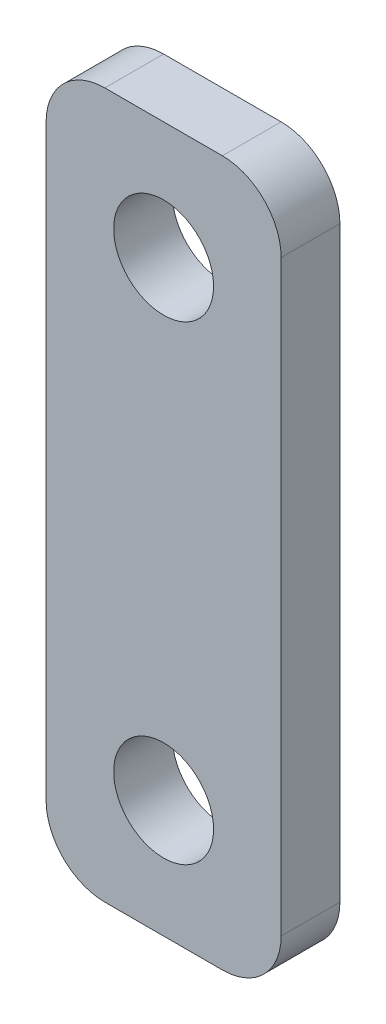
ISO-10303-21;
HEADER;
FILE_DESCRIPTION(('STEP AP214'),'2;1');
FILE_NAME('part.step','',(''),(''),'','','');
FILE_SCHEMA(('AUTOMOTIVE_DESIGN { 1 0 10303 214 1 1 1 1 }'));
ENDSEC;
DATA;
#1=APPLICATION_CONTEXT('core data for automotive mechanical design processes');
#2=APPLICATION_PROTOCOL_DEFINITION('international standard','automotive_design',2000,#1);
#3=PRODUCT_CONTEXT('',#1,'mechanical');
#4=PRODUCT('Part','Part','',(#3));
#5=PRODUCT_RELATED_PRODUCT_CATEGORY('part','',(#4));
#6=PRODUCT_DEFINITION_FORMATION('','',#4);
#7=PRODUCT_DEFINITION_CONTEXT('part definition',#1,'design');
#8=PRODUCT_DEFINITION('design','',#6,#7);
#9=PRODUCT_DEFINITION_SHAPE('','',#8);
#10=(LENGTH_UNIT() NAMED_UNIT(*) SI_UNIT(.MILLI.,.METRE.));
#11=(NAMED_UNIT(*) PLANE_ANGLE_UNIT() SI_UNIT($,.RADIAN.));
#12=(NAMED_UNIT(*) SI_UNIT($,.STERADIAN.) SOLID_ANGLE_UNIT());
#13=UNCERTAINTY_MEASURE_WITH_UNIT(LENGTH_MEASURE(1.E-05),#10,'distance_accuracy_value','');
#14=(GEOMETRIC_REPRESENTATION_CONTEXT(3) GLOBAL_UNCERTAINTY_ASSIGNED_CONTEXT((#13)) GLOBAL_UNIT_ASSIGNED_CONTEXT((#10,
#11,#12)) REPRESENTATION_CONTEXT('',''));
#15=CARTESIAN_POINT('',(0.,0.,0.));
#16=DIRECTION('',(0.,0.,1.));
#17=DIRECTION('',(1.,0.,0.));
#18=AXIS2_PLACEMENT_3D('',#15,#16,#17);
#19=CARTESIAN_POINT('',(49.9999999999998,60.0000000000002,5.00000000000014));
#20=DIRECTION('',(0.999999999999995,0.,0.));
#21=DIRECTION('',(0.,1.,0.));
#22=AXIS2_PLACEMENT_3D('',#19,#20,#21);
#23=PLANE('',#22);
#24=DIRECTION('',(0.,-1.,0.));
#25=VECTOR('',#24,1.);
#26=CARTESIAN_POINT('',(49.9999999999993,60.0000000000006,-5.00000000000003));
#27=LINE('',#26,#25);
#28=CARTESIAN_POINT('',(49.9999999999995,49.9999999999999,-4.99999999999978));
#29=VERTEX_POINT('',#28);
#30=CARTESIAN_POINT('',(49.9999999999996,-50.,-4.99999999999978));
#31=VERTEX_POINT('',#30);
#32=EDGE_CURVE('E142',#29,#31,#27,.T.);
#33=ORIENTED_EDGE('',*,*,#32,.T.);
#34=DIRECTION('',(0.,0.,-1.));
#35=VECTOR('',#34,1.);
#36=CARTESIAN_POINT('',(49.9999999999997,-50.,5.0000000000005));
#37=LINE('',#36,#35);
#38=CARTESIAN_POINT('',(49.9999999999997,-50.,5.0000000000005));
#39=VERTEX_POINT('',#38);
#40=EDGE_CURVE('E117',#31,#39,#37,.F.);
#41=ORIENTED_EDGE('',*,*,#40,.T.);
#42=DIRECTION('',(0.,-1.,0.));
#43=VECTOR('',#42,1.);
#44=CARTESIAN_POINT('',(49.9999999999998,60.0000000000002,5.00000000000014));
#45=LINE('',#44,#43);
#46=CARTESIAN_POINT('',(49.9999999999996,50.0000000000002,5.00000000000014));
#47=VERTEX_POINT('',#46);
#48=EDGE_CURVE('E156',#47,#39,#45,.T.);
#49=ORIENTED_EDGE('',*,*,#48,.F.);
#50=DIRECTION('',(0.,0.,-1.));
#51=VECTOR('',#50,1.);
#52=CARTESIAN_POINT('',(49.9999999999996,50.0000000000002,5.00000000000014));
#53=LINE('',#52,#51);
#54=EDGE_CURVE('E123',#47,#29,#53,.T.);
#55=ORIENTED_EDGE('',*,*,#54,.T.);
#56=EDGE_LOOP('',(#33,#41,#49,#55));
#57=FACE_BOUND('',#56,.T.);
#58=ADVANCED_FACE('F45',(#57),#23,.F.);
#59=CARTESIAN_POINT('',(49.9999999999996,-60.,5.00000000000037));
#60=DIRECTION('',(0.,1.,0.));
#61=DIRECTION('',(0.,0.,1.));
#62=AXIS2_PLACEMENT_3D('',#59,#60,#61);
#63=PLANE('',#62);
#64=DIRECTION('',(0.999999999999995,0.,0.));
#65=VECTOR('',#64,1.);
#66=CARTESIAN_POINT('',(49.9999999999996,-60.,5.00000000000037));
#67=LINE('',#66,#65);
#68=CARTESIAN_POINT('',(59.9999999999995,-60.,4.99999999999992));
#69=VERTEX_POINT('',#68);
#70=CARTESIAN_POINT('',(79.9999999999994,-60.,5.00000000000006));
#71=VERTEX_POINT('',#70);
#72=EDGE_CURVE('E133',#69,#71,#67,.T.);
#73=ORIENTED_EDGE('',*,*,#72,.F.);
#74=DIRECTION('',(0.,0.,-1.));
#75=VECTOR('',#74,1.);
#76=CARTESIAN_POINT('',(59.9999999999995,-60.,4.99999999999992));
#77=LINE('',#76,#75);
#78=CARTESIAN_POINT('',(59.9999999999997,-60.,-4.99999999999995));
#79=VERTEX_POINT('',#78);
#80=EDGE_CURVE('E116',#69,#79,#77,.T.);
#81=ORIENTED_EDGE('',*,*,#80,.T.);
#82=DIRECTION('',(0.999999999999995,0.,0.));
#83=VECTOR('',#82,1.);
#84=CARTESIAN_POINT('',(49.9999999999996,-60.,-4.99999999999937));
#85=LINE('',#84,#83);
#86=CARTESIAN_POINT('',(79.9999999999995,-60.,-4.99999999999967));
#87=VERTEX_POINT('',#86);
#88=EDGE_CURVE('E130',#79,#87,#85,.T.);
#89=ORIENTED_EDGE('',*,*,#88,.T.);
#90=DIRECTION('',(0.,0.,-1.));
#91=VECTOR('',#90,1.);
#92=CARTESIAN_POINT('',(79.9999999999994,-60.,5.00000000000006));
#93=LINE('',#92,#91);
#94=EDGE_CURVE('E136',#87,#71,#93,.F.);
#95=ORIENTED_EDGE('',*,*,#94,.T.);
#96=EDGE_LOOP('',(#73,#81,#89,#95));
#97=FACE_BOUND('',#96,.T.);
#98=ADVANCED_FACE('F129',(#97),#63,.F.);
#99=CARTESIAN_POINT('',(89.9999999999992,60.0000000000002,4.99999999999989));
#100=DIRECTION('',(-0.999999999999995,0.,0.));
#101=DIRECTION('',(0.,-1.,0.));
#102=AXIS2_PLACEMENT_3D('',#99,#100,#101);
#103=PLANE('',#102);
#104=DIRECTION('',(0.,1.,0.));
#105=VECTOR('',#104,1.);
#106=CARTESIAN_POINT('',(89.9999999999992,60.0000000000002,4.99999999999989));
#107=LINE('',#106,#105);
#108=CARTESIAN_POINT('',(89.999999999999,-49.9999999999998,5.00000000000039));
#109=VERTEX_POINT('',#108);
#110=CARTESIAN_POINT('',(89.9999999999991,50.0000000000001,5.00000000000009));
#111=VERTEX_POINT('',#110);
#112=EDGE_CURVE('E209',#109,#111,#107,.T.);
#113=ORIENTED_EDGE('',*,*,#112,.F.);
#114=DIRECTION('',(0.,0.,-1.));
#115=VECTOR('',#114,1.);
#116=CARTESIAN_POINT('',(89.999999999999,-49.9999999999998,5.00000000000039));
#117=LINE('',#116,#115);
#118=CARTESIAN_POINT('',(89.9999999999994,-49.9999999999999,-4.99999999999967));
#119=VERTEX_POINT('',#118);
#120=EDGE_CURVE('E186',#109,#119,#117,.T.);
#121=ORIENTED_EDGE('',*,*,#120,.T.);
#122=DIRECTION('',(0.,1.,0.));
#123=VECTOR('',#122,1.);
#124=CARTESIAN_POINT('',(89.9999999999985,60.0000000000001,-4.99999999999953));
#125=LINE('',#124,#123);
#126=CARTESIAN_POINT('',(89.9999999999996,50.0000000000002,-4.99999999999995));
#127=VERTEX_POINT('',#126);
#128=EDGE_CURVE('E141',#119,#127,#125,.T.);
#129=ORIENTED_EDGE('',*,*,#128,.T.);
#130=DIRECTION('',(0.,0.,-1.));
#131=VECTOR('',#130,1.);
#132=CARTESIAN_POINT('',(89.9999999999991,50.0000000000001,5.00000000000009));
#133=LINE('',#132,#131);
#134=EDGE_CURVE('E183',#127,#111,#133,.F.);
#135=ORIENTED_EDGE('',*,*,#134,.T.);
#136=EDGE_LOOP('',(#113,#121,#129,#135));
#137=FACE_BOUND('',#136,.T.);
#138=ADVANCED_FACE('F270',(#137),#103,.F.);
#139=CARTESIAN_POINT('',(49.9999999999998,60.0000000000002,5.00000000000014));
#140=DIRECTION('',(0.,-1.,0.));
#141=DIRECTION('',(0.999999999999995,0.,0.));
#142=AXIS2_PLACEMENT_3D('',#139,#140,#141);
#143=PLANE('',#142);
#144=DIRECTION('',(-0.999999999999995,0.,0.));
#145=VECTOR('',#144,1.);
#146=CARTESIAN_POINT('',(49.9999999999998,60.0000000000002,5.00000000000014));
#147=LINE('',#146,#145);
#148=CARTESIAN_POINT('',(79.9999999999994,60.0000000000001,5.00000000000006));
#149=VERTEX_POINT('',#148);
#150=CARTESIAN_POINT('',(59.9999999999993,60.0000000000001,5.00000000000006));
#151=VERTEX_POINT('',#150);
#152=EDGE_CURVE('E158',#149,#151,#147,.T.);
#153=ORIENTED_EDGE('',*,*,#152,.F.);
#154=DIRECTION('',(0.,0.,-1.));
#155=VECTOR('',#154,1.);
#156=CARTESIAN_POINT('',(79.9999999999994,60.0000000000001,5.00000000000006));
#157=LINE('',#156,#155);
#158=CARTESIAN_POINT('',(79.9999999999988,60.0000000000001,-4.99999999999962));
#159=VERTEX_POINT('',#158);
#160=EDGE_CURVE('E11',#149,#159,#157,.T.);
#161=ORIENTED_EDGE('',*,*,#160,.T.);
#162=DIRECTION('',(-0.999999999999995,0.,0.));
#163=VECTOR('',#162,1.);
#164=CARTESIAN_POINT('',(49.9999999999993,60.0000000000006,-5.00000000000003));
#165=LINE('',#164,#163);
#166=CARTESIAN_POINT('',(59.9999999999996,60.0000000000001,-4.99999999999981));
#167=VERTEX_POINT('',#166);
#168=EDGE_CURVE('E148',#159,#167,#165,.T.);
#169=ORIENTED_EDGE('',*,*,#168,.T.);
#170=DIRECTION('',(0.,0.,-1.));
#171=VECTOR('',#170,1.);
#172=CARTESIAN_POINT('',(59.9999999999993,60.0000000000001,5.00000000000006));
#173=LINE('',#172,#171);
#174=EDGE_CURVE('E54',#167,#151,#173,.F.);
#175=ORIENTED_EDGE('',*,*,#174,.T.);
#176=EDGE_LOOP('',(#153,#161,#169,#175));
#177=FACE_BOUND('',#176,.T.);
#178=ADVANCED_FACE('F252',(#177),#143,.F.);
#179=CARTESIAN_POINT('',(-6.66133814775094E-13,0.,5.00000000000031));
#180=DIRECTION('',(0.,0.,1.));
#181=DIRECTION('',(0.999999999999995,0.,0.));
#182=AXIS2_PLACEMENT_3D('',#179,#180,#181);
#183=PLANE('',#182);
#184=CARTESIAN_POINT('',(70.0000000000001,-40.,5.00000000000014));
#185=DIRECTION('',(0.,0.,1.));
#186=DIRECTION('',(0.999999999999995,0.,0.));
#187=AXIS2_PLACEMENT_3D('',#184,#185,#186);
#188=CIRCLE('',#187,8.5);
#189=CARTESIAN_POINT('',(78.5,-40.,5.00000000000014));
#190=VERTEX_POINT('',#189);
#191=EDGE_CURVE('E231',#190,#190,#188,.T.);
#192=ORIENTED_EDGE('',*,*,#191,.F.);
#193=EDGE_LOOP('',(#192));
#194=FACE_BOUND('',#193,.T.);
#195=CARTESIAN_POINT('',(69.9999999999993,40.,5.00000000000014));
#196=DIRECTION('',(0.,0.,1.));
#197=DIRECTION('',(0.999999999999995,0.,0.));
#198=AXIS2_PLACEMENT_3D('',#195,#196,#197);
#199=CIRCLE('',#198,8.5);
#200=CARTESIAN_POINT('',(78.4999999999992,40.,5.00000000000014));
#201=VERTEX_POINT('',#200);
#202=EDGE_CURVE('E223',#201,#201,#199,.T.);
#203=ORIENTED_EDGE('',*,*,#202,.F.);
#204=EDGE_LOOP('',(#203));
#205=FACE_BOUND('',#204,.T.);
#206=ORIENTED_EDGE('',*,*,#48,.T.);
#207=CARTESIAN_POINT('',(60.0000000000001,-50.,4.99999999999987));
#208=DIRECTION('',(0.,0.,1.));
#209=DIRECTION('',(0.999999999999995,0.,0.));
#210=AXIS2_PLACEMENT_3D('',#207,#208,#209);
#211=CIRCLE('',#210,10.);
#212=EDGE_CURVE('E180',#39,#69,#211,.T.);
#213=ORIENTED_EDGE('',*,*,#212,.T.);
#214=ORIENTED_EDGE('',*,*,#72,.T.);
#215=CARTESIAN_POINT('',(79.9999999999992,-49.9999999999996,5.00000000000025));
#216=DIRECTION('',(0.,0.,1.));
#217=DIRECTION('',(0.999999999999995,0.,0.));
#218=AXIS2_PLACEMENT_3D('',#215,#216,#217);
#219=CIRCLE('',#218,10.);
#220=EDGE_CURVE('E177',#71,#109,#219,.T.);
#221=ORIENTED_EDGE('',*,*,#220,.T.);
#222=ORIENTED_EDGE('',*,*,#112,.T.);
#223=CARTESIAN_POINT('',(79.9999999999987,50.,5.00000000000023));
#224=DIRECTION('',(0.,0.,1.));
#225=DIRECTION('',(0.999999999999995,0.,0.));
#226=AXIS2_PLACEMENT_3D('',#223,#224,#225);
#227=CIRCLE('',#226,10.);
#228=EDGE_CURVE('E67',#111,#149,#227,.T.);
#229=ORIENTED_EDGE('',*,*,#228,.T.);
#230=ORIENTED_EDGE('',*,*,#152,.T.);
#231=CARTESIAN_POINT('',(59.9999999999992,50.,5.00000000000034));
#232=DIRECTION('',(0.,0.,1.));
#233=DIRECTION('',(0.999999999999995,0.,0.));
#234=AXIS2_PLACEMENT_3D('',#231,#232,#233);
#235=CIRCLE('',#234,10.);
#236=EDGE_CURVE('E172',#151,#47,#235,.T.);
#237=ORIENTED_EDGE('',*,*,#236,.T.);
#238=EDGE_LOOP('',(#206,#213,#214,#221,#222,#229,#230,#237));
#239=FACE_BOUND('',#238,.T.);
#240=ADVANCED_FACE('F249',(#194,#205,#239),#183,.T.);
#241=CARTESIAN_POINT('',(-5.55111512312578E-13,2.77555756156289E-13,-4.99999999999967));
#242=DIRECTION('',(0.,0.,1.));
#243=DIRECTION('',(0.999999999999995,0.,0.));
#244=AXIS2_PLACEMENT_3D('',#241,#242,#243);
#245=PLANE('',#244);
#246=CARTESIAN_POINT('',(69.9999999999994,-40.,-4.99999999999987));
#247=DIRECTION('',(0.,0.,1.));
#248=DIRECTION('',(0.999999999999995,0.,0.));
#249=AXIS2_PLACEMENT_3D('',#246,#247,#248);
#250=CIRCLE('',#249,8.5);
#251=CARTESIAN_POINT('',(78.4999999999993,-40.,-4.99999999999987));
#252=VERTEX_POINT('',#251);
#253=EDGE_CURVE('E227',#252,#252,#250,.T.);
#254=ORIENTED_EDGE('',*,*,#253,.T.);
#255=EDGE_LOOP('',(#254));
#256=FACE_BOUND('',#255,.T.);
#257=CARTESIAN_POINT('',(69.9999999999994,40.0000000000001,-4.99999999999992));
#258=DIRECTION('',(0.,0.,1.));
#259=DIRECTION('',(0.999999999999995,0.,0.));
#260=AXIS2_PLACEMENT_3D('',#257,#258,#259);
#261=CIRCLE('',#260,8.5);
#262=CARTESIAN_POINT('',(78.4999999999993,40.0000000000001,-4.99999999999993));
#263=VERTEX_POINT('',#262);
#264=EDGE_CURVE('E150',#263,#263,#261,.T.);
#265=ORIENTED_EDGE('',*,*,#264,.T.);
#266=EDGE_LOOP('',(#265));
#267=FACE_BOUND('',#266,.T.);
#268=ORIENTED_EDGE('',*,*,#88,.F.);
#269=CARTESIAN_POINT('',(59.9999999999989,-50.,-4.99999999999975));
#270=DIRECTION('',(0.,0.,1.));
#271=DIRECTION('',(0.999999999999995,0.,0.));
#272=AXIS2_PLACEMENT_3D('',#269,#270,#271);
#273=CIRCLE('',#272,10.);
#274=EDGE_CURVE('E112',#79,#31,#273,.F.);
#275=ORIENTED_EDGE('',*,*,#274,.T.);
#276=ORIENTED_EDGE('',*,*,#32,.F.);
#277=CARTESIAN_POINT('',(59.9999999999995,50.0000000000001,-4.99999999999973));
#278=DIRECTION('',(0.,0.,1.));
#279=DIRECTION('',(0.999999999999995,0.,0.));
#280=AXIS2_PLACEMENT_3D('',#277,#278,#279);
#281=CIRCLE('',#280,10.);
#282=EDGE_CURVE('E135',#29,#167,#281,.F.);
#283=ORIENTED_EDGE('',*,*,#282,.T.);
#284=ORIENTED_EDGE('',*,*,#168,.F.);
#285=CARTESIAN_POINT('',(79.9999999999991,50.0000000000002,-4.99999999999987));
#286=DIRECTION('',(0.,0.,1.));
#287=DIRECTION('',(0.999999999999995,0.,0.));
#288=AXIS2_PLACEMENT_3D('',#285,#286,#287);
#289=CIRCLE('',#288,10.);
#290=EDGE_CURVE('E162',#159,#127,#289,.F.);
#291=ORIENTED_EDGE('',*,*,#290,.T.);
#292=ORIENTED_EDGE('',*,*,#128,.F.);
#293=CARTESIAN_POINT('',(79.999999999999,-49.9999999999999,-4.99999999999967));
#294=DIRECTION('',(0.,0.,1.));
#295=DIRECTION('',(0.999999999999995,0.,0.));
#296=AXIS2_PLACEMENT_3D('',#293,#294,#295);
#297=CIRCLE('',#296,10.);
#298=EDGE_CURVE('E124',#119,#87,#297,.F.);
#299=ORIENTED_EDGE('',*,*,#298,.T.);
#300=EDGE_LOOP('',(#268,#275,#276,#283,#284,#291,#292,#299));
#301=FACE_BOUND('',#300,.T.);
#302=ADVANCED_FACE('F138',(#256,#267,#301),#245,.F.);
#303=CARTESIAN_POINT('',(69.9999999999994,40.0000000000001,-4.99999999999992));
#304=DIRECTION('',(0.,0.,1.));
#305=DIRECTION('',(0.999999999999995,0.,0.));
#306=AXIS2_PLACEMENT_3D('',#303,#304,#305);
#307=CYLINDRICAL_SURFACE('',#306,8.5);
#308=ORIENTED_EDGE('',*,*,#264,.F.);
#309=EDGE_LOOP('',(#308));
#310=FACE_BOUND('',#309,.T.);
#311=ORIENTED_EDGE('',*,*,#202,.T.);
#312=EDGE_LOOP('',(#311));
#313=FACE_BOUND('',#312,.T.);
#314=ADVANCED_FACE('F245',(#310,#313),#307,.F.);
#315=CARTESIAN_POINT('',(69.9999999999994,-40.,-4.99999999999987));
#316=DIRECTION('',(0.,0.,1.));
#317=DIRECTION('',(0.999999999999995,0.,0.));
#318=AXIS2_PLACEMENT_3D('',#315,#316,#317);
#319=CYLINDRICAL_SURFACE('',#318,8.5);
#320=ORIENTED_EDGE('',*,*,#253,.F.);
#321=EDGE_LOOP('',(#320));
#322=FACE_BOUND('',#321,.T.);
#323=ORIENTED_EDGE('',*,*,#191,.T.);
#324=EDGE_LOOP('',(#323));
#325=FACE_BOUND('',#324,.T.);
#326=ADVANCED_FACE('F242',(#322,#325),#319,.F.);
#327=CARTESIAN_POINT('',(60.0000000000001,-50.,4.99999999999987));
#328=DIRECTION('',(0.,0.,-1.));
#329=DIRECTION('',(-0.999999999999995,0.,0.));
#330=AXIS2_PLACEMENT_3D('',#327,#328,#329);
#331=CYLINDRICAL_SURFACE('',#330,10.);
#332=ORIENTED_EDGE('',*,*,#212,.F.);
#333=ORIENTED_EDGE('',*,*,#40,.F.);
#334=ORIENTED_EDGE('',*,*,#274,.F.);
#335=ORIENTED_EDGE('',*,*,#80,.F.);
#336=EDGE_LOOP('',(#332,#333,#334,#335));
#337=FACE_BOUND('',#336,.T.);
#338=ADVANCED_FACE('F115',(#337),#331,.T.);
#339=CARTESIAN_POINT('',(79.9999999999992,-49.9999999999996,5.00000000000025));
#340=DIRECTION('',(0.,0.,-1.));
#341=DIRECTION('',(-0.999999999999995,0.,0.));
#342=AXIS2_PLACEMENT_3D('',#339,#340,#341);
#343=CYLINDRICAL_SURFACE('',#342,10.);
#344=ORIENTED_EDGE('',*,*,#220,.F.);
#345=ORIENTED_EDGE('',*,*,#94,.F.);
#346=ORIENTED_EDGE('',*,*,#298,.F.);
#347=ORIENTED_EDGE('',*,*,#120,.F.);
#348=EDGE_LOOP('',(#344,#345,#346,#347));
#349=FACE_BOUND('',#348,.T.);
#350=ADVANCED_FACE('F276',(#349),#343,.T.);
#351=CARTESIAN_POINT('',(79.9999999999987,50.,5.00000000000023));
#352=DIRECTION('',(0.,0.,-1.));
#353=DIRECTION('',(-0.999999999999995,0.,0.));
#354=AXIS2_PLACEMENT_3D('',#351,#352,#353);
#355=CYLINDRICAL_SURFACE('',#354,10.);
#356=ORIENTED_EDGE('',*,*,#228,.F.);
#357=ORIENTED_EDGE('',*,*,#134,.F.);
#358=ORIENTED_EDGE('',*,*,#290,.F.);
#359=ORIENTED_EDGE('',*,*,#160,.F.);
#360=EDGE_LOOP('',(#356,#357,#358,#359));
#361=FACE_BOUND('',#360,.T.);
#362=ADVANCED_FACE('F278',(#361),#355,.T.);
#363=CARTESIAN_POINT('',(59.9999999999992,50.,5.00000000000034));
#364=DIRECTION('',(0.,0.,-1.));
#365=DIRECTION('',(-0.999999999999995,0.,0.));
#366=AXIS2_PLACEMENT_3D('',#363,#364,#365);
#367=CYLINDRICAL_SURFACE('',#366,10.);
#368=ORIENTED_EDGE('',*,*,#236,.F.);
#369=ORIENTED_EDGE('',*,*,#174,.F.);
#370=ORIENTED_EDGE('',*,*,#282,.F.);
#371=ORIENTED_EDGE('',*,*,#54,.F.);
#372=EDGE_LOOP('',(#368,#369,#370,#371));
#373=FACE_BOUND('',#372,.T.);
#374=ADVANCED_FACE('F47',(#373),#367,.T.);
#375=CLOSED_SHELL('',(#58,#98,#138,#178,#240,#302,#314,#326,#338,#350,#362,#374));
#376=MANIFOLD_SOLID_BREP('B2',#375);
#377=ADVANCED_BREP_SHAPE_REPRESENTATION('',(#18,#376),#14);
#378=SHAPE_DEFINITION_REPRESENTATION(#9,#377);
ENDSEC;
END-ISO-10303-21;
